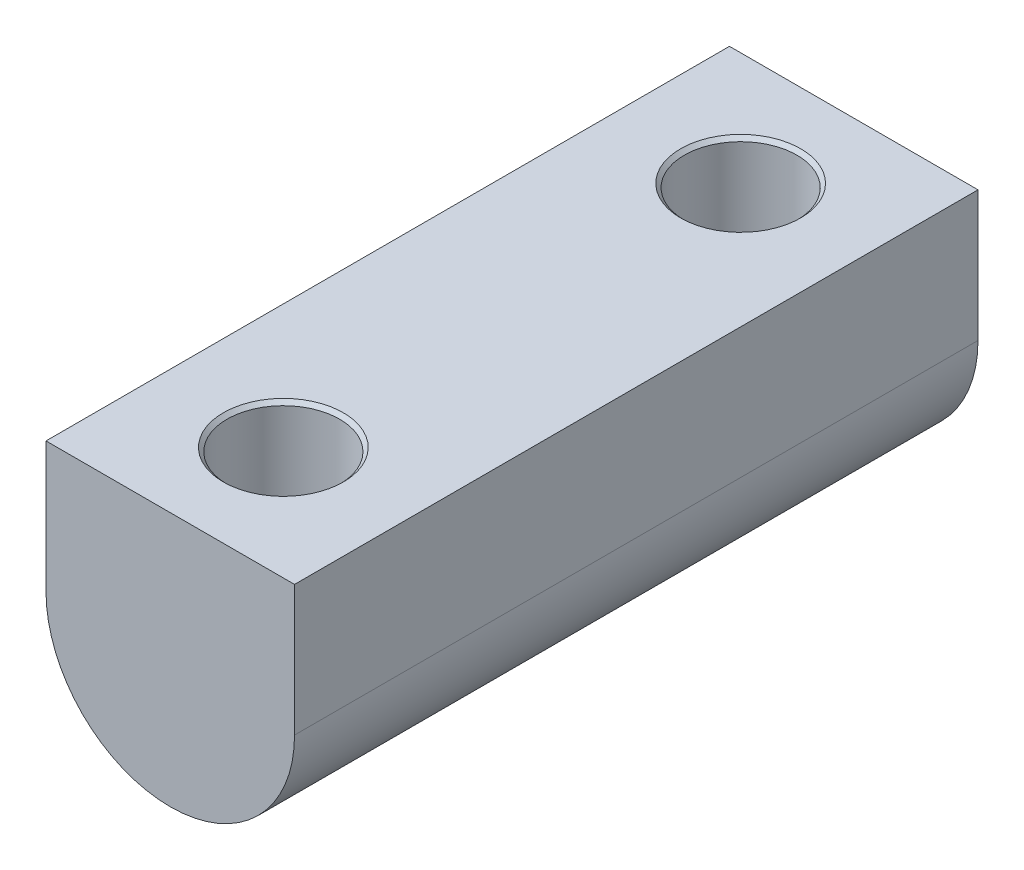
ISO-10303-21;
HEADER;
FILE_DESCRIPTION(('STEP AP214'),'2;1');
FILE_NAME('part.step','',(''),(''),'','','');
FILE_SCHEMA(('AUTOMOTIVE_DESIGN { 1 0 10303 214 1 1 1 1 }'));
ENDSEC;
DATA;
#1=APPLICATION_CONTEXT('core data for automotive mechanical design processes');
#2=APPLICATION_PROTOCOL_DEFINITION('international standard','automotive_design',2000,#1);
#3=PRODUCT_CONTEXT('',#1,'mechanical');
#4=PRODUCT('Part','Part','',(#3));
#5=PRODUCT_RELATED_PRODUCT_CATEGORY('part','',(#4));
#6=PRODUCT_DEFINITION_FORMATION('','',#4);
#7=PRODUCT_DEFINITION_CONTEXT('part definition',#1,'design');
#8=PRODUCT_DEFINITION('design','',#6,#7);
#9=PRODUCT_DEFINITION_SHAPE('','',#8);
#10=(LENGTH_UNIT() NAMED_UNIT(*) SI_UNIT(.MILLI.,.METRE.));
#11=(NAMED_UNIT(*) PLANE_ANGLE_UNIT() SI_UNIT($,.RADIAN.));
#12=(NAMED_UNIT(*) SI_UNIT($,.STERADIAN.) SOLID_ANGLE_UNIT());
#13=UNCERTAINTY_MEASURE_WITH_UNIT(LENGTH_MEASURE(1.E-05),#10,'distance_accuracy_value','');
#14=(GEOMETRIC_REPRESENTATION_CONTEXT(3) GLOBAL_UNCERTAINTY_ASSIGNED_CONTEXT((#13)) GLOBAL_UNIT_ASSIGNED_CONTEXT((#10,
#11,#12)) REPRESENTATION_CONTEXT('',''));
#15=CARTESIAN_POINT('',(0.,0.,0.));
#16=DIRECTION('',(0.,0.,1.));
#17=DIRECTION('',(1.,0.,0.));
#18=AXIS2_PLACEMENT_3D('',#15,#16,#17);
#19=CARTESIAN_POINT('',(-25.4,26.67,139.7));
#20=DIRECTION('',(0.,-1.,0.));
#21=DIRECTION('',(0.,0.,-1.));
#22=AXIS2_PLACEMENT_3D('',#19,#20,#21);
#23=PLANE('',#22);
#24=CARTESIAN_POINT('',(0.,26.67,23.114));
#25=DIRECTION('',(0.,1.,0.));
#26=DIRECTION('',(0.,0.,1.));
#27=AXIS2_PLACEMENT_3D('',#24,#25,#26);
#28=CIRCLE('',#27,12.2682);
#29=CARTESIAN_POINT('',(0.,26.67,35.3822));
#30=VERTEX_POINT('',#29);
#31=EDGE_CURVE('E235',#30,#30,#28,.T.);
#32=ORIENTED_EDGE('',*,*,#31,.F.);
#33=EDGE_LOOP('',(#32));
#34=FACE_BOUND('',#33,.T.);
#35=CARTESIAN_POINT('',(0.,26.67,116.586));
#36=DIRECTION('',(0.,1.,0.));
#37=DIRECTION('',(0.,0.,1.));
#38=AXIS2_PLACEMENT_3D('',#35,#36,#37);
#39=CIRCLE('',#38,12.2682);
#40=CARTESIAN_POINT('',(0.,26.67,128.8542));
#41=VERTEX_POINT('',#40);
#42=EDGE_CURVE('E185',#41,#41,#39,.T.);
#43=ORIENTED_EDGE('',*,*,#42,.F.);
#44=EDGE_LOOP('',(#43));
#45=FACE_BOUND('',#44,.T.);
#46=DIRECTION('',(-1.,0.,0.));
#47=VECTOR('',#46,1.);
#48=CARTESIAN_POINT('',(-25.4,26.67,0.));
#49=LINE('',#48,#47);
#50=CARTESIAN_POINT('',(25.4,26.67,0.));
#51=VERTEX_POINT('',#50);
#52=CARTESIAN_POINT('',(-25.4,26.67,0.));
#53=VERTEX_POINT('',#52);
#54=EDGE_CURVE('E183',#51,#53,#49,.T.);
#55=ORIENTED_EDGE('',*,*,#54,.T.);
#56=DIRECTION('',(0.,0.,-1.));
#57=VECTOR('',#56,1.);
#58=CARTESIAN_POINT('',(-25.4,26.67,139.7));
#59=LINE('',#58,#57);
#60=CARTESIAN_POINT('',(-25.4,26.67,139.7));
#61=VERTEX_POINT('',#60);
#62=EDGE_CURVE('E215',#61,#53,#59,.T.);
#63=ORIENTED_EDGE('',*,*,#62,.F.);
#64=DIRECTION('',(-1.,0.,0.));
#65=VECTOR('',#64,1.);
#66=CARTESIAN_POINT('',(-25.4,26.67,139.7));
#67=LINE('',#66,#65);
#68=CARTESIAN_POINT('',(25.4,26.67,139.7));
#69=VERTEX_POINT('',#68);
#70=EDGE_CURVE('E189',#69,#61,#67,.T.);
#71=ORIENTED_EDGE('',*,*,#70,.F.);
#72=DIRECTION('',(0.,0.,-1.));
#73=VECTOR('',#72,1.);
#74=CARTESIAN_POINT('',(25.4,26.67,139.7));
#75=LINE('',#74,#73);
#76=EDGE_CURVE('E199',#69,#51,#75,.T.);
#77=ORIENTED_EDGE('',*,*,#76,.T.);
#78=EDGE_LOOP('',(#55,#63,#71,#77));
#79=FACE_BOUND('',#78,.T.);
#80=ADVANCED_FACE('F32',(#34,#45,#79),#23,.F.);
#81=CARTESIAN_POINT('',(-25.4,0.,139.7));
#82=DIRECTION('',(1.,0.,0.));
#83=DIRECTION('',(0.,1.,0.));
#84=AXIS2_PLACEMENT_3D('',#81,#82,#83);
#85=PLANE('',#84);
#86=DIRECTION('',(0.,-1.,0.));
#87=VECTOR('',#86,1.);
#88=CARTESIAN_POINT('',(-25.4,0.,0.));
#89=LINE('',#88,#87);
#90=CARTESIAN_POINT('',(-25.4,0.,0.));
#91=VERTEX_POINT('',#90);
#92=EDGE_CURVE('E202',#53,#91,#89,.T.);
#93=ORIENTED_EDGE('',*,*,#92,.T.);
#94=DIRECTION('',(0.,0.,-1.));
#95=VECTOR('',#94,1.);
#96=CARTESIAN_POINT('',(-25.4,0.,139.7));
#97=LINE('',#96,#95);
#98=CARTESIAN_POINT('',(-25.4,0.,139.7));
#99=VERTEX_POINT('',#98);
#100=EDGE_CURVE('E212',#99,#91,#97,.T.);
#101=ORIENTED_EDGE('',*,*,#100,.F.);
#102=DIRECTION('',(0.,-1.,0.));
#103=VECTOR('',#102,1.);
#104=CARTESIAN_POINT('',(-25.4,0.,139.7));
#105=LINE('',#104,#103);
#106=EDGE_CURVE('E192',#61,#99,#105,.T.);
#107=ORIENTED_EDGE('',*,*,#106,.F.);
#108=ORIENTED_EDGE('',*,*,#62,.T.);
#109=EDGE_LOOP('',(#93,#101,#107,#108));
#110=FACE_BOUND('',#109,.T.);
#111=ADVANCED_FACE('F226',(#110),#85,.F.);
#112=CARTESIAN_POINT('',(0.,0.,139.7));
#113=DIRECTION('',(0.,0.,-1.));
#114=DIRECTION('',(-1.,0.,0.));
#115=AXIS2_PLACEMENT_3D('',#112,#113,#114);
#116=CYLINDRICAL_SURFACE('',#115,25.4);
#117=CARTESIAN_POINT('',(-6.16218261814553,-24.641175,13.3932377731348));
#118=CARTESIAN_POINT('',(-6.44191342892057,-24.5712453339657,13.5705526587333));
#119=CARTESIAN_POINT('',(-6.71339515120926,-24.4982689565312,13.7595870718681));
#120=CARTESIAN_POINT('',(-7.23838743542873,-24.3483047488872,14.1596550717247));
#121=CARTESIAN_POINT('',(-7.4919008553563,-24.2713175600233,14.3706851466154));
#122=CARTESIAN_POINT('',(-7.98009634270316,-24.1152229593519,14.813836485438));
#123=CARTESIAN_POINT('',(-8.21473687799224,-24.0361113563613,15.0460019911032));
#124=CARTESIAN_POINT('',(-8.6632753202409,-23.8781110022992,15.5296641318405));
#125=CARTESIAN_POINT('',(-8.87717237747819,-23.7992222604851,15.7811615580569));
#126=CARTESIAN_POINT('',(-9.28298489194657,-23.643887755276,16.3021737401673));
#127=CARTESIAN_POINT('',(-9.47489252217419,-23.5674428686939,16.5716948577612));
#128=CARTESIAN_POINT('',(-9.83531134444654,-23.4193215085058,17.1271839362858));
#129=CARTESIAN_POINT('',(-10.0038239817867,-23.3476447404778,17.4131508796816));
#130=CARTESIAN_POINT('',(-10.3159782819042,-23.2114106203455,17.9996520510586));
#131=CARTESIAN_POINT('',(-10.4596419428034,-23.1468469897513,18.3001730898304));
#132=CARTESIAN_POINT('',(-10.7209178039334,-23.0269972168615,18.9141295345266));
#133=CARTESIAN_POINT('',(-10.8385313269917,-22.9717106035131,19.2275642837328));
#134=CARTESIAN_POINT('',(-11.0429983040855,-22.8741035374996,19.8546933850308));
#135=CARTESIAN_POINT('',(-11.1307330395805,-22.8314177264025,20.1680430233582));
#136=CARTESIAN_POINT('',(-11.2795589208124,-22.7582610864342,20.8024227814634));
#137=CARTESIAN_POINT('',(-11.3406506790771,-22.7277899767458,21.1234527244903));
#138=CARTESIAN_POINT('',(-11.4353451061038,-22.6802931801161,21.7703505818019));
#139=CARTESIAN_POINT('',(-11.4689632366746,-22.663259930705,22.0962156696392));
#140=CARTESIAN_POINT('',(-11.5082787810938,-22.643321813047,22.750045996279));
#141=CARTESIAN_POINT('',(-11.5139786654205,-22.6404156946941,23.0780110466846));
#142=CARTESIAN_POINT('',(-11.4982143003797,-22.6484238127957,23.7003405873378));
#143=CARTESIAN_POINT('',(-11.4794025189142,-22.6579886088728,23.9947939989724));
#144=CARTESIAN_POINT('',(-11.4193238386268,-22.6883269107744,24.5807968441577));
#145=CARTESIAN_POINT('',(-11.3780586155195,-22.7090995801474,24.8723464927648));
#146=CARTESIAN_POINT('',(-11.2735428101021,-22.761164910562,25.4505044711947));
#147=CARTESIAN_POINT('',(-11.2102924721311,-22.7924574546873,25.7371128558968));
#148=CARTESIAN_POINT('',(-11.0624679755939,-22.864569847183,26.3035451936817));
#149=CARTESIAN_POINT('',(-10.9778931178168,-22.9053900079517,26.5833689239723));
#150=CARTESIAN_POINT('',(-10.7880685902922,-22.9954042216774,27.1350090847275));
#151=CARTESIAN_POINT('',(-10.682786919897,-23.044611219885,27.4068123629408));
#152=CARTESIAN_POINT('',(-10.4524675729035,-23.1499882212746,27.9406102668827));
#153=CARTESIAN_POINT('',(-10.3274233481846,-23.2061605310078,28.2026016058085));
#154=CARTESIAN_POINT('',(-10.0584051391043,-23.3240231875673,28.7156204918425));
#155=CARTESIAN_POINT('',(-9.91441763912759,-23.3857174640544,28.9666400388337));
#156=CARTESIAN_POINT('',(-9.60847376693834,-23.5130747501233,29.4564230077683));
#157=CARTESIAN_POINT('',(-9.44651640228219,-23.5787379788121,29.6951857517242));
#158=CARTESIAN_POINT('',(-9.0882943309944,-23.719265475134,30.1828870174996));
#159=CARTESIAN_POINT('',(-8.8902168604682,-23.7943895971751,30.4304212372558));
#160=CARTESIAN_POINT('',(-8.47455641488981,-23.9455794969405,30.9080883724703));
#161=CARTESIAN_POINT('',(-8.25697877055135,-24.0216450124474,31.1382260120679));
#162=CARTESIAN_POINT('',(-7.80383417304395,-24.1726522408291,31.5795629315074));
#163=CARTESIAN_POINT('',(-7.56829920511696,-24.247595679975,31.7907944916206));
#164=CARTESIAN_POINT('',(-7.08020012273026,-24.3945821858311,32.1934528344003));
#165=CARTESIAN_POINT('',(-6.82764694019815,-24.4666270678541,32.3848921343595));
#166=CARTESIAN_POINT('',(-6.50075070358878,-24.5541237874548,32.6120273422549));
#167=CARTESIAN_POINT('',(-6.43370992289067,-24.5717775073043,32.6575667950416));
#168=CARTESIAN_POINT('',(-6.29867203567288,-24.6067386320881,32.7472238966789));
#169=CARTESIAN_POINT('',(-6.23067569357582,-24.6240462896904,32.7913425983808));
#170=CARTESIAN_POINT('',(-6.16218261814553,-24.641175,32.8347622268652));
#171=B_SPLINE_CURVE_WITH_KNOTS('',3,(#117,#118,#119,#120,#121,#122,#123,#124,#125,#126,#127,
#128,#129,#130,#131,#132,#133,#134,#135,#136,#137,#138,#139,#140,#141,#142,#143,#144,#145,#146,
#147,#148,#149,#150,#151,#152,#153,#154,#155,#156,#157,#158,#159,#160,#161,#162,#163,#164,#165,
#166,#167,#168,#169,#170),.UNSPECIFIED.,.F.,.F.,(4,2,2,2,2,2,2,2,2,2,2,2,2,2,2,2,2,2,2,2,2,2,2,
2,2,2,4),(0.,1.0151067998878,2.03005177519394,3.04717240405228,4.0643346799919,5.08185789132828,
6.09931821413678,7.11587314494733,8.132376443198,9.11558762481931,10.0987762010133,
11.0814110693672,12.0639589830415,12.9485143613801,13.8330037338446,14.7174832765508,
15.6019918242804,16.4878782016516,17.3740587261939,18.2608749853606,19.1477402462081,
20.1240958100394,21.1001852793828,22.0745750458268,23.0483447563993,23.2971701228159,
23.5458066424416),.UNSPECIFIED.);
#172=CARTESIAN_POINT('',(-6.16218261814578,-24.641175,13.3932377731348));
#173=VERTEX_POINT('',#172);
#174=CARTESIAN_POINT('',(-6.16218261814553,-24.641175,32.8347622268652));
#175=VERTEX_POINT('',#174);
#176=EDGE_CURVE('E107',#173,#175,#171,.T.);
#177=ORIENTED_EDGE('',*,*,#176,.T.);
#178=CARTESIAN_POINT('',(-6.45881029806911,-24.5650925,32.548190316297));
#179=CARTESIAN_POINT('',(-6.26240196904254,-24.6167336657644,32.7452458499962));
#180=CARTESIAN_POINT('',(-6.05837654376768,-24.6678587753081,32.934990924439));
#181=CARTESIAN_POINT('',(-5.63534504801485,-24.7679265977663,33.2981846652509));
#182=CARTESIAN_POINT('',(-5.41631980681127,-24.8168663806434,33.4716117783393));
#183=CARTESIAN_POINT('',(-4.96284546434878,-24.9115252046395,33.8008500716212));
#184=CARTESIAN_POINT('',(-4.72832003002384,-24.9572255898274,33.9565619168995));
#185=CARTESIAN_POINT('',(-4.24592372455164,-25.0438038905117,34.2470724861902));
#186=CARTESIAN_POINT('',(-3.99806018530966,-25.0846844168137,34.3818825447996));
#187=CARTESIAN_POINT('',(-3.53502306400233,-25.1536943197178,34.6067215332955));
#188=CARTESIAN_POINT('',(-3.32178992719408,-25.1828010982893,34.7004552684766));
#189=CARTESIAN_POINT('',(-2.8881211655666,-25.2362132140815,34.8710886961727));
#190=CARTESIAN_POINT('',(-2.66768685232898,-25.2605194200318,34.9479914347607));
#191=CARTESIAN_POINT('',(-2.22138414977597,-25.3036673635464,35.0836953197831));
#192=CARTESIAN_POINT('',(-1.9955307164065,-25.3225226046793,35.1425412206926));
#193=CARTESIAN_POINT('',(-1.53932810370089,-25.3543436473139,35.2414589079046));
#194=CARTESIAN_POINT('',(-1.30897896692402,-25.3673095045402,35.2815308718437));
#195=CARTESIAN_POINT('',(-0.844419566337968,-25.3870289875341,35.3423529552535));
#196=CARTESIAN_POINT('',(-0.610196640220688,-25.3937545656943,35.3630158436324));
#197=CARTESIAN_POINT('',(-0.140740277769136,-25.4006948726566,35.3843370824184));
#198=CARTESIAN_POINT('',(0.0944931674837493,-25.4009095438763,35.3849952559042));
#199=CARTESIAN_POINT('',(0.564134638538382,-25.3948206844323,35.3662921044337));
#200=CARTESIAN_POINT('',(0.798542439221797,-25.3885154961623,35.3469256884346));
#201=CARTESIAN_POINT('',(1.2646186660876,-25.3695712118022,35.2885167285817));
#202=CARTESIAN_POINT('',(1.49628716969701,-25.3569322951768,35.2494747422309));
#203=CARTESIAN_POINT('',(1.94267707063293,-25.3265332739928,35.1550329149762));
#204=CARTESIAN_POINT('',(2.15763410589165,-25.3090897100041,35.10064020883));
#205=CARTESIAN_POINT('',(2.58234750357772,-25.2692907938601,34.97565376219));
#206=CARTESIAN_POINT('',(2.79210212595171,-25.2469338223267,34.9050546799997));
#207=CARTESIAN_POINT('',(3.41230690662832,-25.173184540836,34.6701253556688));
#208=CARTESIAN_POINT('',(3.81341652206548,-25.115134043209,34.4827241332053));
#209=CARTESIAN_POINT('',(4.61642922997843,-24.9805630697333,34.0367082415512));
#210=CARTESIAN_POINT('',(5.01550488001561,-24.9028924601575,33.7733962312934));
#211=CARTESIAN_POINT('',(5.58162094334254,-24.7798851758998,33.3403382926949));
#212=CARTESIAN_POINT('',(5.76460755628981,-24.7378811901644,33.1899442693297));
#213=CARTESIAN_POINT('',(6.11979206682041,-24.6524118412353,32.8775359735813));
#214=CARTESIAN_POINT('',(6.291997415195,-24.6089475199071,32.7155298959844));
#215=CARTESIAN_POINT('',(6.45881029806911,-24.5650925,32.548190316297));
#216=B_SPLINE_CURVE_WITH_KNOTS('',3,(#178,#179,#180,#181,#182,#183,#184,#185,#186,#187,#188,
#189,#190,#191,#192,#193,#194,#195,#196,#197,#198,#199,#200,#201,#202,#203,#204,#205,#206,#207,
#208,#209,#210,#211,#212,#213,#214,#215),.UNSPECIFIED.,.F.,.F.,(4,2,2,2,2,2,2,2,2,2,2,2,2,2,2,2,
2,2,4),(0.,0.848877466539811,1.69886086420922,2.55339716233528,3.40746843041591,
4.11097213252556,4.81434840908948,5.51596699383079,6.21757893980853,6.92232929343885,
7.62708587986797,8.3320216873696,9.03693752179431,9.70344682348516,10.3701761259578,
11.7044912788221,13.1521612537161,13.873385791261,14.5941062690893),.UNSPECIFIED.);
#217=CARTESIAN_POINT('',(6.16218261814553,-24.641175,32.8347622268652));
#218=VERTEX_POINT('',#217);
#219=EDGE_CURVE('E11',#175,#218,#216,.T.);
#220=ORIENTED_EDGE('',*,*,#219,.T.);
#221=CARTESIAN_POINT('',(6.16218261814553,-24.641175,32.8347622268652));
#222=CARTESIAN_POINT('',(6.44191342892057,-24.5712453339657,32.6574473412667));
#223=CARTESIAN_POINT('',(6.71339515120926,-24.4982689565312,32.4684129281319));
#224=CARTESIAN_POINT('',(7.23838743542874,-24.3483047488872,32.0683449282753));
#225=CARTESIAN_POINT('',(7.4919008553563,-24.2713175600233,31.8573148533846));
#226=CARTESIAN_POINT('',(7.98009634270316,-24.1152229593519,31.414163514562));
#227=CARTESIAN_POINT('',(8.21473687799225,-24.0361113563613,31.1819980088968));
#228=CARTESIAN_POINT('',(8.6632753202409,-23.8781110022992,30.6983358681595));
#229=CARTESIAN_POINT('',(8.87717237747819,-23.7992222604851,30.4468384419431));
#230=CARTESIAN_POINT('',(9.28298489194657,-23.643887755276,29.9258262598327));
#231=CARTESIAN_POINT('',(9.4748925221742,-23.5674428686939,29.6563051422388));
#232=CARTESIAN_POINT('',(9.83531134444655,-23.4193215085059,29.1008160637142));
#233=CARTESIAN_POINT('',(10.0038239817867,-23.3476447404778,28.8148491203184));
#234=CARTESIAN_POINT('',(10.3159782819042,-23.2114106203455,28.2283479489414));
#235=CARTESIAN_POINT('',(10.4596419428034,-23.1468469897513,27.9278269101696));
#236=CARTESIAN_POINT('',(10.7209178039334,-23.0269972168615,27.3138704654734));
#237=CARTESIAN_POINT('',(10.8385313269917,-22.9717106035131,27.0004357162671));
#238=CARTESIAN_POINT('',(11.0429983040855,-22.8741035374996,26.3733066149692));
#239=CARTESIAN_POINT('',(11.1307330395805,-22.8314177264025,26.0599569766418));
#240=CARTESIAN_POINT('',(11.2795589208124,-22.7582610864342,25.4255772185366));
#241=CARTESIAN_POINT('',(11.3406506790771,-22.7277899767458,25.1045472755097));
#242=CARTESIAN_POINT('',(11.4353451061038,-22.6802931801161,24.4576494181981));
#243=CARTESIAN_POINT('',(11.4689632366746,-22.663259930705,24.1317843303608));
#244=CARTESIAN_POINT('',(11.5082787810938,-22.643321813047,23.477954003721));
#245=CARTESIAN_POINT('',(11.5139786654205,-22.6404156946941,23.1499889533154));
#246=CARTESIAN_POINT('',(11.4982143003797,-22.6484238127957,22.5276594126622));
#247=CARTESIAN_POINT('',(11.4794025189142,-22.6579886088728,22.2332060010275));
#248=CARTESIAN_POINT('',(11.4193238386268,-22.6883269107744,21.6472031558423));
#249=CARTESIAN_POINT('',(11.3780586155195,-22.7090995801474,21.3556535072352));
#250=CARTESIAN_POINT('',(11.2735428101021,-22.761164910562,20.7774955288053));
#251=CARTESIAN_POINT('',(11.2102924721311,-22.7924574546873,20.4908871441032));
#252=CARTESIAN_POINT('',(11.0624679755939,-22.864569847183,19.9244548063183));
#253=CARTESIAN_POINT('',(10.9778931178168,-22.9053900079517,19.6446310760277));
#254=CARTESIAN_POINT('',(10.7880685902922,-22.9954042216774,19.0929909152725));
#255=CARTESIAN_POINT('',(10.682786919897,-23.044611219885,18.8211876370591));
#256=CARTESIAN_POINT('',(10.4524675729035,-23.1499882212746,18.2873897331173));
#257=CARTESIAN_POINT('',(10.3274233481846,-23.2061605310078,18.0253983941915));
#258=CARTESIAN_POINT('',(10.0584051391043,-23.3240231875673,17.5123795081575));
#259=CARTESIAN_POINT('',(9.91441763912759,-23.3857174640544,17.2613599611663));
#260=CARTESIAN_POINT('',(9.60847376693834,-23.5130747501233,16.7715769922317));
#261=CARTESIAN_POINT('',(9.44651640228219,-23.5787379788121,16.5328142482758));
#262=CARTESIAN_POINT('',(9.0882943309944,-23.719265475134,16.0451129825004));
#263=CARTESIAN_POINT('',(8.8902168604682,-23.7943895971751,15.7975787627442));
#264=CARTESIAN_POINT('',(8.4745564148898,-23.9455794969405,15.3199116275297));
#265=CARTESIAN_POINT('',(8.25697877055135,-24.0216450124474,15.0897739879321));
#266=CARTESIAN_POINT('',(7.80383417304395,-24.1726522408291,14.6484370684926));
#267=CARTESIAN_POINT('',(7.56829920511695,-24.247595679975,14.4372055083794));
#268=CARTESIAN_POINT('',(7.08020012273026,-24.3945821858311,14.0345471655997));
#269=CARTESIAN_POINT('',(6.82764694019815,-24.4666270678541,13.8431078656405));
#270=CARTESIAN_POINT('',(6.50075070358878,-24.5541237874548,13.615972657745));
#271=CARTESIAN_POINT('',(6.43370992289067,-24.5717775073044,13.5704332049584));
#272=CARTESIAN_POINT('',(6.29867203567287,-24.6067386320881,13.4807761033211));
#273=CARTESIAN_POINT('',(6.23067569357581,-24.6240462896904,13.4366574016191));
#274=CARTESIAN_POINT('',(6.16218261814553,-24.641175,13.3932377731348));
#275=B_SPLINE_CURVE_WITH_KNOTS('',3,(#221,#222,#223,#224,#225,#226,#227,#228,#229,#230,#231,
#232,#233,#234,#235,#236,#237,#238,#239,#240,#241,#242,#243,#244,#245,#246,#247,#248,#249,#250,
#251,#252,#253,#254,#255,#256,#257,#258,#259,#260,#261,#262,#263,#264,#265,#266,#267,#268,#269,
#270,#271,#272,#273,#274),.UNSPECIFIED.,.F.,.F.,(4,2,2,2,2,2,2,2,2,2,2,2,2,2,2,2,2,2,2,2,2,2,2,
2,2,2,4),(0.,1.01510679988781,2.03005177519395,3.04717240405228,4.0643346799919,
5.08185789132828,6.09931821413678,7.11587314494733,8.132376443198,9.11558762481931,
10.0987762010133,11.0814110693671,12.0639589830415,12.9485143613801,13.8330037338446,
14.7174832765508,15.6019918242804,16.4878782016516,17.3740587261939,18.2608749853606,
19.1477402462081,20.1240958100394,21.1001852793828,22.0745750458268,23.0483447563994,
23.297170122816,23.5458066424416),.UNSPECIFIED.);
#276=CARTESIAN_POINT('',(6.16218261814553,-24.641175,13.3932377731348));
#277=VERTEX_POINT('',#276);
#278=EDGE_CURVE('E44',#218,#277,#275,.T.);
#279=ORIENTED_EDGE('',*,*,#278,.T.);
#280=CARTESIAN_POINT('',(6.45881029806911,-24.5650925,13.679809683703));
#281=CARTESIAN_POINT('',(6.26240196904254,-24.6167336657644,13.4827541500038));
#282=CARTESIAN_POINT('',(6.05837654376768,-24.6678587753081,13.293009075561));
#283=CARTESIAN_POINT('',(5.63534504801486,-24.7679265977663,12.929815334749));
#284=CARTESIAN_POINT('',(5.41631980681127,-24.8168663806434,12.7563882216607));
#285=CARTESIAN_POINT('',(4.96284546434878,-24.9115252046395,12.4271499283787));
#286=CARTESIAN_POINT('',(4.72832003002384,-24.9572255898274,12.2714380831005));
#287=CARTESIAN_POINT('',(4.24592372455164,-25.0438038905117,11.9809275138098));
#288=CARTESIAN_POINT('',(3.99806018530966,-25.0846844168137,11.8461174552004));
#289=CARTESIAN_POINT('',(3.53502306400233,-25.1536943197178,11.6212784667045));
#290=CARTESIAN_POINT('',(3.32178992719408,-25.1828010982893,11.5275447315234));
#291=CARTESIAN_POINT('',(2.88812116556661,-25.2362132140815,11.3569113038273));
#292=CARTESIAN_POINT('',(2.66768685232898,-25.2605194200318,11.2800085652393));
#293=CARTESIAN_POINT('',(2.22138414977598,-25.3036673635464,11.1443046802169));
#294=CARTESIAN_POINT('',(1.9955307164065,-25.3225226046793,11.0854587793073));
#295=CARTESIAN_POINT('',(1.53932810370089,-25.3543436473139,10.9865410920954));
#296=CARTESIAN_POINT('',(1.30897896692402,-25.3673095045402,10.9464691281563));
#297=CARTESIAN_POINT('',(0.844419566337971,-25.3870289875341,10.8856470447465));
#298=CARTESIAN_POINT('',(0.61019664022069,-25.3937545656943,10.8649841563676));
#299=CARTESIAN_POINT('',(0.140740277769137,-25.4006948726566,10.8436629175816));
#300=CARTESIAN_POINT('',(-0.0944931674837482,-25.4009095438763,10.8430047440958));
#301=CARTESIAN_POINT('',(-0.564134638538381,-25.3948206844323,10.8617078955663));
#302=CARTESIAN_POINT('',(-0.798542439221796,-25.3885154961623,10.8810743115654));
#303=CARTESIAN_POINT('',(-1.2646186660876,-25.3695712118022,10.9394832714183));
#304=CARTESIAN_POINT('',(-1.49628716969701,-25.3569322951768,10.9785252577691));
#305=CARTESIAN_POINT('',(-1.94267707063293,-25.3265332739928,11.0729670850238));
#306=CARTESIAN_POINT('',(-2.15763410589165,-25.3090897100041,11.12735979117));
#307=CARTESIAN_POINT('',(-2.58234750357773,-25.2692907938601,11.25234623781));
#308=CARTESIAN_POINT('',(-2.79210212595171,-25.2469338223267,11.3229453200002));
#309=CARTESIAN_POINT('',(-3.41230690662832,-25.173184540836,11.5578746443311));
#310=CARTESIAN_POINT('',(-3.81341652206548,-25.115134043209,11.7452758667947));
#311=CARTESIAN_POINT('',(-4.61642922997843,-24.9805630697333,12.1912917584488));
#312=CARTESIAN_POINT('',(-5.01550488001561,-24.9028924601575,12.4546037687066));
#313=CARTESIAN_POINT('',(-5.58162094334255,-24.7798851758998,12.887661707305));
#314=CARTESIAN_POINT('',(-5.76460755628981,-24.7378811901644,13.0380557306703));
#315=CARTESIAN_POINT('',(-6.11979206682042,-24.6524118412353,13.3504640264187));
#316=CARTESIAN_POINT('',(-6.291997415195,-24.6089475199071,13.5124701040155));
#317=CARTESIAN_POINT('',(-6.45881029806911,-24.5650925,13.679809683703));
#318=B_SPLINE_CURVE_WITH_KNOTS('',3,(#280,#281,#282,#283,#284,#285,#286,#287,#288,#289,#290,
#291,#292,#293,#294,#295,#296,#297,#298,#299,#300,#301,#302,#303,#304,#305,#306,#307,#308,#309,
#310,#311,#312,#313,#314,#315,#316,#317),.UNSPECIFIED.,.F.,.F.,(4,2,2,2,2,2,2,2,2,2,2,2,2,2,2,2,
2,2,4),(0.,0.848877466539813,1.69886086420923,2.55339716233528,3.40746843041591,
4.11097213252556,4.81434840908949,5.5159669938308,6.21757893980853,6.92232929343885,
7.62708587986798,8.3320216873696,9.03693752179431,9.70344682348516,10.3701761259578,
11.7044912788221,13.1521612537161,13.873385791261,14.5941062690893),.UNSPECIFIED.);
#319=EDGE_CURVE('E114',#277,#173,#318,.T.);
#320=ORIENTED_EDGE('',*,*,#319,.T.);
#321=EDGE_LOOP('',(#177,#220,#279,#320));
#322=FACE_BOUND('',#321,.T.);
#323=CARTESIAN_POINT('',(-6.16218261814553,-24.641175,106.865237773135));
#324=CARTESIAN_POINT('',(-6.44191342892057,-24.5712453339657,107.042552658733));
#325=CARTESIAN_POINT('',(-6.71339515120926,-24.4982689565312,107.231587071868));
#326=CARTESIAN_POINT('',(-7.23838743542873,-24.3483047488872,107.631655071725));
#327=CARTESIAN_POINT('',(-7.4919008553563,-24.2713175600233,107.842685146615));
#328=CARTESIAN_POINT('',(-7.98009634270316,-24.1152229593519,108.285836485438));
#329=CARTESIAN_POINT('',(-8.21473687799225,-24.0361113563613,108.518001991103));
#330=CARTESIAN_POINT('',(-8.6632753202409,-23.8781110022992,109.001664131841));
#331=CARTESIAN_POINT('',(-8.87717237747819,-23.7992222604851,109.253161558057));
#332=CARTESIAN_POINT('',(-9.28298489194657,-23.643887755276,109.774173740167));
#333=CARTESIAN_POINT('',(-9.47489252217419,-23.5674428686939,110.043694857761));
#334=CARTESIAN_POINT('',(-9.83531134444654,-23.4193215085058,110.599183936286));
#335=CARTESIAN_POINT('',(-10.0038239817867,-23.3476447404778,110.885150879682));
#336=CARTESIAN_POINT('',(-10.3159782819042,-23.2114106203455,111.471652051059));
#337=CARTESIAN_POINT('',(-10.4596419428034,-23.1468469897513,111.77217308983));
#338=CARTESIAN_POINT('',(-10.7209178039334,-23.0269972168615,112.386129534527));
#339=CARTESIAN_POINT('',(-10.8385313269917,-22.9717106035131,112.699564283733));
#340=CARTESIAN_POINT('',(-11.0429983040855,-22.8741035374996,113.326693385031));
#341=CARTESIAN_POINT('',(-11.1307330395805,-22.8314177264025,113.640043023358));
#342=CARTESIAN_POINT('',(-11.2795589208124,-22.7582610864342,114.274422781463));
#343=CARTESIAN_POINT('',(-11.3406506790771,-22.7277899767458,114.59545272449));
#344=CARTESIAN_POINT('',(-11.4353451061037,-22.6802931801162,115.242350581802));
#345=CARTESIAN_POINT('',(-11.4689632366746,-22.663259930705,115.568215669639));
#346=CARTESIAN_POINT('',(-11.5082787810937,-22.643321813047,116.222045996279));
#347=CARTESIAN_POINT('',(-11.5139786654205,-22.6404156946941,116.550011046685));
#348=CARTESIAN_POINT('',(-11.4982143003797,-22.6484238127957,117.172340587338));
#349=CARTESIAN_POINT('',(-11.4794025189142,-22.6579886088728,117.466793998972));
#350=CARTESIAN_POINT('',(-11.4193238386268,-22.6883269107744,118.052796844158));
#351=CARTESIAN_POINT('',(-11.3780586155195,-22.7090995801474,118.344346492765));
#352=CARTESIAN_POINT('',(-11.2735428101021,-22.761164910562,118.922504471195));
#353=CARTESIAN_POINT('',(-11.210292472131,-22.7924574546873,119.209112855897));
#354=CARTESIAN_POINT('',(-11.0624679755938,-22.864569847183,119.775545193682));
#355=CARTESIAN_POINT('',(-10.9778931178168,-22.9053900079517,120.055368923972));
#356=CARTESIAN_POINT('',(-10.7880685902921,-22.9954042216774,120.607009084728));
#357=CARTESIAN_POINT('',(-10.682786919897,-23.044611219885,120.878812362941));
#358=CARTESIAN_POINT('',(-10.4524675729034,-23.1499882212746,121.412610266883));
#359=CARTESIAN_POINT('',(-10.3274233481846,-23.2061605310078,121.674601605808));
#360=CARTESIAN_POINT('',(-10.0584051391042,-23.3240231875673,122.187620491842));
#361=CARTESIAN_POINT('',(-9.91441763912758,-23.3857174640544,122.438640038834));
#362=CARTESIAN_POINT('',(-9.60847376693832,-23.5130747501233,122.928423007768));
#363=CARTESIAN_POINT('',(-9.44651640228217,-23.5787379788121,123.167185751724));
#364=CARTESIAN_POINT('',(-9.08829433099439,-23.719265475134,123.6548870175));
#365=CARTESIAN_POINT('',(-8.89021686046817,-23.7943895971751,123.902421237256));
#366=CARTESIAN_POINT('',(-8.47455641488978,-23.9455794969405,124.38008837247));
#367=CARTESIAN_POINT('',(-8.25697877055132,-24.0216450124474,124.610226012068));
#368=CARTESIAN_POINT('',(-7.80383417304392,-24.1726522408291,125.051562931507));
#369=CARTESIAN_POINT('',(-7.56829920511692,-24.247595679975,125.262794491621));
#370=CARTESIAN_POINT('',(-7.08020012273022,-24.3945821858311,125.6654528344));
#371=CARTESIAN_POINT('',(-6.8276469401981,-24.4666270678541,125.856892134359));
#372=CARTESIAN_POINT('',(-6.50075070358874,-24.5541237874548,126.084027342255));
#373=CARTESIAN_POINT('',(-6.43370992289064,-24.5717775073044,126.129566795042));
#374=CARTESIAN_POINT('',(-6.29867203567286,-24.6067386320881,126.219223896679));
#375=CARTESIAN_POINT('',(-6.2306756935758,-24.6240462896904,126.263342598381));
#376=CARTESIAN_POINT('',(-6.16218261814553,-24.641175,126.306762226865));
#377=B_SPLINE_CURVE_WITH_KNOTS('',3,(#323,#324,#325,#326,#327,#328,#329,#330,#331,#332,#333,
#334,#335,#336,#337,#338,#339,#340,#341,#342,#343,#344,#345,#346,#347,#348,#349,#350,#351,#352,
#353,#354,#355,#356,#357,#358,#359,#360,#361,#362,#363,#364,#365,#366,#367,#368,#369,#370,#371,
#372,#373,#374,#375,#376),.UNSPECIFIED.,.F.,.F.,(4,2,2,2,2,2,2,2,2,2,2,2,2,2,2,2,2,2,2,2,2,2,2,
2,2,2,4),(0.,1.0151067998878,2.03005177519395,3.04717240405227,4.06433467999191,
5.08185789132827,6.09931821413678,7.11587314494734,8.13237644319801,9.11558762481931,
10.0987762010133,11.0814110693672,12.0639589830415,12.9485143613801,13.8330037338446,
14.7174832765508,15.6019918242805,16.4878782016516,17.3740587261939,18.2608749853606,
19.1477402462081,20.1240958100394,21.1001852793828,22.0745750458268,23.0483447563994,
23.2971701228159,23.5458066424416),.UNSPECIFIED.);
#378=CARTESIAN_POINT('',(-6.16218261814578,-24.641175,106.865237773135));
#379=VERTEX_POINT('',#378);
#380=CARTESIAN_POINT('',(-6.16218261814553,-24.641175,126.306762226865));
#381=VERTEX_POINT('',#380);
#382=EDGE_CURVE('E158',#379,#381,#377,.T.);
#383=ORIENTED_EDGE('',*,*,#382,.T.);
#384=CARTESIAN_POINT('',(-6.45881029806911,-24.5650925,126.020190316297));
#385=CARTESIAN_POINT('',(-6.26240196904255,-24.6167336657644,126.217245849996));
#386=CARTESIAN_POINT('',(-6.05837654376769,-24.6678587753081,126.406990924439));
#387=CARTESIAN_POINT('',(-5.63534504801486,-24.7679265977663,126.770184665251));
#388=CARTESIAN_POINT('',(-5.41631980681127,-24.8168663806434,126.943611778339));
#389=CARTESIAN_POINT('',(-4.96284546434878,-24.9115252046395,127.272850071621));
#390=CARTESIAN_POINT('',(-4.72832003002384,-24.9572255898274,127.428561916899));
#391=CARTESIAN_POINT('',(-4.24592372455164,-25.0438038905117,127.71907248619));
#392=CARTESIAN_POINT('',(-3.99806018530966,-25.0846844168137,127.8538825448));
#393=CARTESIAN_POINT('',(-3.53502306400233,-25.1536943197178,128.078721533295));
#394=CARTESIAN_POINT('',(-3.32178992719408,-25.1828010982893,128.172455268477));
#395=CARTESIAN_POINT('',(-2.88812116556661,-25.2362132140815,128.343088696173));
#396=CARTESIAN_POINT('',(-2.66768685232898,-25.2605194200318,128.419991434761));
#397=CARTESIAN_POINT('',(-2.22138414977598,-25.3036673635464,128.555695319783));
#398=CARTESIAN_POINT('',(-1.99553071640651,-25.3225226046793,128.614541220693));
#399=CARTESIAN_POINT('',(-1.53932810370089,-25.3543436473139,128.713458907905));
#400=CARTESIAN_POINT('',(-1.30897896692402,-25.3673095045402,128.753530871844));
#401=CARTESIAN_POINT('',(-0.844419566337967,-25.3870289875341,128.814352955253));
#402=CARTESIAN_POINT('',(-0.610196640220687,-25.3937545656943,128.835015843632));
#403=CARTESIAN_POINT('',(-0.140740277769133,-25.4006948726566,128.856337082418));
#404=CARTESIAN_POINT('',(0.0944931674837525,-25.4009095438763,128.856995255904));
#405=CARTESIAN_POINT('',(0.564134638538386,-25.3948206844323,128.838292104434));
#406=CARTESIAN_POINT('',(0.7985424392218,-25.3885154961623,128.818925688435));
#407=CARTESIAN_POINT('',(1.2646186660876,-25.3695712118022,128.760516728582));
#408=CARTESIAN_POINT('',(1.49628716969702,-25.3569322951768,128.721474742231));
#409=CARTESIAN_POINT('',(1.94267707063294,-25.3265332739928,128.627032914976));
#410=CARTESIAN_POINT('',(2.15763410589165,-25.3090897100041,128.57264020883));
#411=CARTESIAN_POINT('',(2.58234750357773,-25.2692907938601,128.44765376219));
#412=CARTESIAN_POINT('',(2.79210212595172,-25.2469338223267,128.37705468));
#413=CARTESIAN_POINT('',(3.41230690662833,-25.173184540836,128.142125355669));
#414=CARTESIAN_POINT('',(3.81341652206548,-25.115134043209,127.954724133205));
#415=CARTESIAN_POINT('',(4.61642922997843,-24.9805630697333,127.508708241551));
#416=CARTESIAN_POINT('',(5.01550488001562,-24.9028924601575,127.245396231293));
#417=CARTESIAN_POINT('',(5.58162094334255,-24.7798851758998,126.812338292695));
#418=CARTESIAN_POINT('',(5.76460755628982,-24.7378811901644,126.66194426933));
#419=CARTESIAN_POINT('',(6.11979206682042,-24.6524118412353,126.349535973581));
#420=CARTESIAN_POINT('',(6.291997415195,-24.6089475199071,126.187529895984));
#421=CARTESIAN_POINT('',(6.45881029806911,-24.5650925,126.020190316297));
#422=B_SPLINE_CURVE_WITH_KNOTS('',3,(#384,#385,#386,#387,#388,#389,#390,#391,#392,#393,#394,
#395,#396,#397,#398,#399,#400,#401,#402,#403,#404,#405,#406,#407,#408,#409,#410,#411,#412,#413,
#414,#415,#416,#417,#418,#419,#420,#421),.UNSPECIFIED.,.F.,.F.,(4,2,2,2,2,2,2,2,2,2,2,2,2,2,2,2,
2,2,4),(0.,0.848877466539808,1.69886086420923,2.55339716233528,3.40746843041591,
4.11097213252557,4.81434840908949,5.5159669938308,6.21757893980854,6.92232929343886,
7.62708587986799,8.33202168736961,9.03693752179432,9.70344682348516,10.3701761259578,
11.7044912788222,13.1521612537161,13.873385791261,14.5941062690893),.UNSPECIFIED.);
#423=CARTESIAN_POINT('',(6.16218261814553,-24.641175,126.306762226865));
#424=VERTEX_POINT('',#423);
#425=EDGE_CURVE('E116',#381,#424,#422,.T.);
#426=ORIENTED_EDGE('',*,*,#425,.T.);
#427=CARTESIAN_POINT('',(6.16218261814553,-24.641175,126.306762226865));
#428=CARTESIAN_POINT('',(6.44191342892056,-24.5712453339657,126.129447341267));
#429=CARTESIAN_POINT('',(6.71339515120925,-24.4982689565312,125.940412928132));
#430=CARTESIAN_POINT('',(7.23838743542873,-24.3483047488872,125.540344928275));
#431=CARTESIAN_POINT('',(7.4919008553563,-24.2713175600233,125.329314853385));
#432=CARTESIAN_POINT('',(7.98009634270316,-24.1152229593519,124.886163514562));
#433=CARTESIAN_POINT('',(8.21473687799225,-24.0361113563613,124.653998008897));
#434=CARTESIAN_POINT('',(8.6632753202409,-23.8781110022992,124.170335868159));
#435=CARTESIAN_POINT('',(8.87717237747819,-23.7992222604851,123.918838441943));
#436=CARTESIAN_POINT('',(9.28298489194657,-23.643887755276,123.397826259833));
#437=CARTESIAN_POINT('',(9.4748925221742,-23.5674428686939,123.128305142239));
#438=CARTESIAN_POINT('',(9.83531134444655,-23.4193215085058,122.572816063714));
#439=CARTESIAN_POINT('',(10.0038239817867,-23.3476447404778,122.286849120318));
#440=CARTESIAN_POINT('',(10.3159782819042,-23.2114106203455,121.700347948941));
#441=CARTESIAN_POINT('',(10.4596419428034,-23.1468469897513,121.39982691017));
#442=CARTESIAN_POINT('',(10.7209178039334,-23.0269972168615,120.785870465473));
#443=CARTESIAN_POINT('',(10.8385313269917,-22.9717106035131,120.472435716267));
#444=CARTESIAN_POINT('',(11.0429983040855,-22.8741035374996,119.845306614969));
#445=CARTESIAN_POINT('',(11.1307330395805,-22.8314177264025,119.531956976642));
#446=CARTESIAN_POINT('',(11.2795589208124,-22.7582610864342,118.897577218537));
#447=CARTESIAN_POINT('',(11.3406506790771,-22.7277899767458,118.57654727551));
#448=CARTESIAN_POINT('',(11.4353451061038,-22.6802931801161,117.929649418198));
#449=CARTESIAN_POINT('',(11.4689632366746,-22.663259930705,117.603784330361));
#450=CARTESIAN_POINT('',(11.5082787810938,-22.643321813047,116.949954003721));
#451=CARTESIAN_POINT('',(11.5139786654205,-22.6404156946941,116.621988953315));
#452=CARTESIAN_POINT('',(11.4982143003797,-22.6484238127957,115.999659412662));
#453=CARTESIAN_POINT('',(11.4794025189142,-22.6579886088727,115.705206001028));
#454=CARTESIAN_POINT('',(11.4193238386269,-22.6883269107744,115.119203155842));
#455=CARTESIAN_POINT('',(11.3780586155195,-22.7090995801474,114.827653507235));
#456=CARTESIAN_POINT('',(11.2735428101021,-22.761164910562,114.249495528805));
#457=CARTESIAN_POINT('',(11.2102924721311,-22.7924574546873,113.962887144103));
#458=CARTESIAN_POINT('',(11.0624679755939,-22.864569847183,113.396454806318));
#459=CARTESIAN_POINT('',(10.9778931178168,-22.9053900079517,113.116631076028));
#460=CARTESIAN_POINT('',(10.7880685902922,-22.9954042216774,112.564990915272));
#461=CARTESIAN_POINT('',(10.682786919897,-23.044611219885,112.293187637059));
#462=CARTESIAN_POINT('',(10.4524675729035,-23.1499882212746,111.759389733117));
#463=CARTESIAN_POINT('',(10.3274233481846,-23.2061605310078,111.497398394192));
#464=CARTESIAN_POINT('',(10.0584051391043,-23.3240231875673,110.984379508158));
#465=CARTESIAN_POINT('',(9.91441763912761,-23.3857174640543,110.733359961166));
#466=CARTESIAN_POINT('',(9.60847376693836,-23.5130747501233,110.243576992232));
#467=CARTESIAN_POINT('',(9.44651640228221,-23.5787379788121,110.004814248276));
#468=CARTESIAN_POINT('',(9.08829433099443,-23.719265475134,109.5171129825));
#469=CARTESIAN_POINT('',(8.89021686046822,-23.7943895971751,109.269578762744));
#470=CARTESIAN_POINT('',(8.47455641488983,-23.9455794969405,108.79191162753));
#471=CARTESIAN_POINT('',(8.25697877055138,-24.0216450124474,108.561773987932));
#472=CARTESIAN_POINT('',(7.80383417304398,-24.1726522408291,108.120437068493));
#473=CARTESIAN_POINT('',(7.56829920511698,-24.2475956799749,107.909205508379));
#474=CARTESIAN_POINT('',(7.08020012273029,-24.3945821858311,107.5065471656));
#475=CARTESIAN_POINT('',(6.82764694019819,-24.4666270678541,107.31510786564));
#476=CARTESIAN_POINT('',(6.50075070358881,-24.5541237874548,107.087972657745));
#477=CARTESIAN_POINT('',(6.4337099228907,-24.5717775073043,107.042433204958));
#478=CARTESIAN_POINT('',(6.2986720356729,-24.6067386320881,106.952776103321));
#479=CARTESIAN_POINT('',(6.23067569357582,-24.6240462896904,106.908657401619));
#480=CARTESIAN_POINT('',(6.16218261814554,-24.641175,106.865237773135));
#481=B_SPLINE_CURVE_WITH_KNOTS('',3,(#427,#428,#429,#430,#431,#432,#433,#434,#435,#436,#437,
#438,#439,#440,#441,#442,#443,#444,#445,#446,#447,#448,#449,#450,#451,#452,#453,#454,#455,#456,
#457,#458,#459,#460,#461,#462,#463,#464,#465,#466,#467,#468,#469,#470,#471,#472,#473,#474,#475,
#476,#477,#478,#479,#480),.UNSPECIFIED.,.F.,.F.,(4,2,2,2,2,2,2,2,2,2,2,2,2,2,2,2,2,2,2,2,2,2,2,
2,2,2,4),(0.,1.0151067998878,2.03005177519395,3.04717240405228,4.0643346799919,5.08185789132829,
6.09931821413678,7.11587314494734,8.132376443198,9.11558762481929,10.0987762010133,
11.0814110693671,12.0639589830415,12.9485143613801,13.8330037338446,14.7174832765508,
15.6019918242804,16.4878782016516,17.3740587261939,18.2608749853606,19.1477402462081,
20.1240958100394,21.1001852793828,22.0745750458268,23.0483447563993,23.2971701228159,
23.5458066424416),.UNSPECIFIED.);
#482=CARTESIAN_POINT('',(6.16218261814553,-24.641175,106.865237773135));
#483=VERTEX_POINT('',#482);
#484=EDGE_CURVE('E164',#424,#483,#481,.T.);
#485=ORIENTED_EDGE('',*,*,#484,.T.);
#486=CARTESIAN_POINT('',(6.45881029806911,-24.5650925,107.151809683703));
#487=CARTESIAN_POINT('',(6.26240196904254,-24.6167336657644,106.954754150004));
#488=CARTESIAN_POINT('',(6.05837654376768,-24.6678587753081,106.765009075561));
#489=CARTESIAN_POINT('',(5.63534504801485,-24.7679265977663,106.401815334749));
#490=CARTESIAN_POINT('',(5.41631980681127,-24.8168663806434,106.228388221661));
#491=CARTESIAN_POINT('',(4.96284546434878,-24.9115252046395,105.899149928379));
#492=CARTESIAN_POINT('',(4.72832003002383,-24.9572255898274,105.7434380831));
#493=CARTESIAN_POINT('',(4.24592372455163,-25.0438038905117,105.45292751381));
#494=CARTESIAN_POINT('',(3.99806018530965,-25.0846844168137,105.3181174552));
#495=CARTESIAN_POINT('',(3.53502306400233,-25.1536943197178,105.093278466705));
#496=CARTESIAN_POINT('',(3.32178992719408,-25.1828010982893,104.999544731523));
#497=CARTESIAN_POINT('',(2.88812116556661,-25.2362132140815,104.828911303827));
#498=CARTESIAN_POINT('',(2.66768685232898,-25.2605194200318,104.752008565239));
#499=CARTESIAN_POINT('',(2.22138414977598,-25.3036673635464,104.616304680217));
#500=CARTESIAN_POINT('',(1.99553071640651,-25.3225226046793,104.557458779307));
#501=CARTESIAN_POINT('',(1.53932810370089,-25.3543436473139,104.458541092095));
#502=CARTESIAN_POINT('',(1.30897896692403,-25.3673095045402,104.418469128156));
#503=CARTESIAN_POINT('',(0.844419566337975,-25.3870289875341,104.357647044746));
#504=CARTESIAN_POINT('',(0.610196640220694,-25.3937545656943,104.336984156368));
#505=CARTESIAN_POINT('',(0.140740277769142,-25.4006948726566,104.315662917582));
#506=CARTESIAN_POINT('',(-0.0944931674837418,-25.4009095438763,104.315004744096));
#507=CARTESIAN_POINT('',(-0.564134638538373,-25.3948206844323,104.333707895566));
#508=CARTESIAN_POINT('',(-0.798542439221787,-25.3885154961623,104.353074311565));
#509=CARTESIAN_POINT('',(-1.26461866608759,-25.3695712118022,104.411483271418));
#510=CARTESIAN_POINT('',(-1.496287169697,-25.3569322951768,104.450525257769));
#511=CARTESIAN_POINT('',(-1.94267707063293,-25.3265332739928,104.544967085024));
#512=CARTESIAN_POINT('',(-2.15763410589164,-25.3090897100041,104.59935979117));
#513=CARTESIAN_POINT('',(-2.58234750357772,-25.2692907938601,104.72434623781));
#514=CARTESIAN_POINT('',(-2.7921021259517,-25.2469338223267,104.79494532));
#515=CARTESIAN_POINT('',(-3.41230690662831,-25.173184540836,105.029874644331));
#516=CARTESIAN_POINT('',(-3.81341652206547,-25.115134043209,105.217275866795));
#517=CARTESIAN_POINT('',(-4.61642922997842,-24.9805630697333,105.663291758449));
#518=CARTESIAN_POINT('',(-5.0155048800156,-24.9028924601575,105.926603768707));
#519=CARTESIAN_POINT('',(-5.58162094334254,-24.7798851758998,106.359661707305));
#520=CARTESIAN_POINT('',(-5.7646075562898,-24.7378811901644,106.51005573067));
#521=CARTESIAN_POINT('',(-6.11979206682041,-24.6524118412353,106.822464026419));
#522=CARTESIAN_POINT('',(-6.29199741519499,-24.6089475199071,106.984470104016));
#523=CARTESIAN_POINT('',(-6.4588102980691,-24.5650925,107.151809683703));
#524=B_SPLINE_CURVE_WITH_KNOTS('',3,(#486,#487,#488,#489,#490,#491,#492,#493,#494,#495,#496,
#497,#498,#499,#500,#501,#502,#503,#504,#505,#506,#507,#508,#509,#510,#511,#512,#513,#514,#515,
#516,#517,#518,#519,#520,#521,#522,#523),.UNSPECIFIED.,.F.,.F.,(4,2,2,2,2,2,2,2,2,2,2,2,2,2,2,2,
2,2,4),(0.,0.848877466539814,1.69886086420923,2.55339716233528,3.40746843041591,
4.11097213252555,4.81434840908948,5.51596699383078,6.21757893980852,6.92232929343884,
7.62708587986796,8.33202168736958,9.03693752179429,9.70344682348515,10.3701761259577,
11.7044912788221,13.1521612537161,13.873385791261,14.5941062690893),.UNSPECIFIED.);
#525=EDGE_CURVE('E217',#483,#379,#524,.T.);
#526=ORIENTED_EDGE('',*,*,#525,.T.);
#527=EDGE_LOOP('',(#383,#426,#485,#526));
#528=FACE_BOUND('',#527,.T.);
#529=CARTESIAN_POINT('',(0.,0.,0.));
#530=DIRECTION('',(0.,0.,1.));
#531=DIRECTION('',(1.,0.,0.));
#532=AXIS2_PLACEMENT_3D('',#529,#530,#531);
#533=CIRCLE('',#532,25.4);
#534=CARTESIAN_POINT('',(25.4,0.,0.));
#535=VERTEX_POINT('',#534);
#536=EDGE_CURVE('E204',#91,#535,#533,.T.);
#537=ORIENTED_EDGE('',*,*,#536,.T.);
#538=DIRECTION('',(0.,0.,-1.));
#539=VECTOR('',#538,1.);
#540=CARTESIAN_POINT('',(25.4,0.,139.7));
#541=LINE('',#540,#539);
#542=CARTESIAN_POINT('',(25.4,0.,139.7));
#543=VERTEX_POINT('',#542);
#544=EDGE_CURVE('E209',#543,#535,#541,.T.);
#545=ORIENTED_EDGE('',*,*,#544,.F.);
#546=CARTESIAN_POINT('',(0.,0.,139.7));
#547=DIRECTION('',(0.,0.,1.));
#548=DIRECTION('',(1.,0.,0.));
#549=AXIS2_PLACEMENT_3D('',#546,#547,#548);
#550=CIRCLE('',#549,25.4);
#551=EDGE_CURVE('E195',#99,#543,#550,.T.);
#552=ORIENTED_EDGE('',*,*,#551,.F.);
#553=ORIENTED_EDGE('',*,*,#100,.T.);
#554=EDGE_LOOP('',(#537,#545,#552,#553));
#555=FACE_BOUND('',#554,.T.);
#556=ADVANCED_FACE('F112',(#322,#528,#555),#116,.T.);
#557=CARTESIAN_POINT('',(25.4,26.67,139.7));
#558=DIRECTION('',(-1.,0.,0.));
#559=DIRECTION('',(0.,-1.,0.));
#560=AXIS2_PLACEMENT_3D('',#557,#558,#559);
#561=PLANE('',#560);
#562=DIRECTION('',(0.,1.,0.));
#563=VECTOR('',#562,1.);
#564=CARTESIAN_POINT('',(25.4,26.67,0.));
#565=LINE('',#564,#563);
#566=EDGE_CURVE('E193',#535,#51,#565,.T.);
#567=ORIENTED_EDGE('',*,*,#566,.T.);
#568=ORIENTED_EDGE('',*,*,#76,.F.);
#569=DIRECTION('',(0.,1.,0.));
#570=VECTOR('',#569,1.);
#571=CARTESIAN_POINT('',(25.4,26.67,139.7));
#572=LINE('',#571,#570);
#573=EDGE_CURVE('E197',#543,#69,#572,.T.);
#574=ORIENTED_EDGE('',*,*,#573,.F.);
#575=ORIENTED_EDGE('',*,*,#544,.T.);
#576=EDGE_LOOP('',(#567,#568,#574,#575));
#577=FACE_BOUND('',#576,.T.);
#578=ADVANCED_FACE('F253',(#577),#561,.F.);
#579=CARTESIAN_POINT('',(0.,0.,139.7));
#580=DIRECTION('',(0.,0.,1.));
#581=DIRECTION('',(1.,0.,0.));
#582=AXIS2_PLACEMENT_3D('',#579,#580,#581);
#583=PLANE('',#582);
#584=ORIENTED_EDGE('',*,*,#70,.T.);
#585=ORIENTED_EDGE('',*,*,#106,.T.);
#586=ORIENTED_EDGE('',*,*,#551,.T.);
#587=ORIENTED_EDGE('',*,*,#573,.T.);
#588=EDGE_LOOP('',(#584,#585,#586,#587));
#589=FACE_BOUND('',#588,.T.);
#590=ADVANCED_FACE('F249',(#589),#583,.T.);
#591=CARTESIAN_POINT('',(0.,0.,0.));
#592=DIRECTION('',(0.,0.,1.));
#593=DIRECTION('',(1.,0.,0.));
#594=AXIS2_PLACEMENT_3D('',#591,#592,#593);
#595=PLANE('',#594);
#596=ORIENTED_EDGE('',*,*,#54,.F.);
#597=ORIENTED_EDGE('',*,*,#566,.F.);
#598=ORIENTED_EDGE('',*,*,#536,.F.);
#599=ORIENTED_EDGE('',*,*,#92,.F.);
#600=EDGE_LOOP('',(#596,#597,#598,#599));
#601=FACE_BOUND('',#600,.T.);
#602=ADVANCED_FACE('F152',(#601),#595,.F.);
#603=CARTESIAN_POINT('',(0.,26.67,116.586));
#604=DIRECTION('',(0.,1.,0.));
#605=DIRECTION('',(0.,0.,1.));
#606=AXIS2_PLACEMENT_3D('',#603,#604,#605);
#607=CYLINDRICAL_SURFACE('',#606,11.509375);
#608=CARTESIAN_POINT('',(0.,25.911175,116.586));
#609=DIRECTION('',(0.,1.,0.));
#610=DIRECTION('',(0.,0.,1.));
#611=AXIS2_PLACEMENT_3D('',#608,#609,#610);
#612=CIRCLE('',#611,11.509375);
#613=CARTESIAN_POINT('',(0.,25.911175,128.095375));
#614=VERTEX_POINT('',#613);
#615=EDGE_CURVE('E181',#614,#614,#612,.T.);
#616=ORIENTED_EDGE('',*,*,#615,.T.);
#617=EDGE_LOOP('',(#616));
#618=FACE_BOUND('',#617,.T.);
#619=CARTESIAN_POINT('',(0.,-24.641175,116.586));
#620=DIRECTION('',(0.,1.,0.));
#621=DIRECTION('',(0.,0.,1.));
#622=AXIS2_PLACEMENT_3D('',#619,#620,#621);
#623=CIRCLE('',#622,11.509375);
#624=EDGE_CURVE('E179',#381,#424,#623,.T.);
#625=ORIENTED_EDGE('',*,*,#624,.F.);
#626=ORIENTED_EDGE('',*,*,#382,.F.);
#627=EDGE_CURVE('E57',#483,#379,#623,.T.);
#628=ORIENTED_EDGE('',*,*,#627,.F.);
#629=ORIENTED_EDGE('',*,*,#484,.F.);
#630=EDGE_LOOP('',(#625,#626,#628,#629));
#631=FACE_BOUND('',#630,.T.);
#632=ADVANCED_FACE('F147',(#618,#631),#607,.F.);
#633=CARTESIAN_POINT('',(0.,-24.641175,116.586));
#634=DIRECTION('',(0.,-1.,0.));
#635=DIRECTION('',(0.,0.,-1.));
#636=AXIS2_PLACEMENT_3D('',#633,#634,#635);
#637=CONICAL_SURFACE('',#636,11.509375,0.785398163397452);
#638=ORIENTED_EDGE('',*,*,#624,.T.);
#639=ORIENTED_EDGE('',*,*,#425,.F.);
#640=EDGE_LOOP('',(#638,#639));
#641=FACE_BOUND('',#640,.T.);
#642=ADVANCED_FACE('F151',(#641),#637,.F.);
#643=ORIENTED_EDGE('',*,*,#627,.T.);
#644=ORIENTED_EDGE('',*,*,#525,.F.);
#645=EDGE_LOOP('',(#643,#644));
#646=FACE_BOUND('',#645,.T.);
#647=ADVANCED_FACE('F145',(#646),#637,.F.);
#648=CARTESIAN_POINT('',(0.,26.67,116.586));
#649=DIRECTION('',(0.,1.,0.));
#650=DIRECTION('',(0.,0.,1.));
#651=AXIS2_PLACEMENT_3D('',#648,#649,#650);
#652=CONICAL_SURFACE('',#651,12.2682,0.785398163397451);
#653=ORIENTED_EDGE('',*,*,#615,.F.);
#654=EDGE_LOOP('',(#653));
#655=FACE_BOUND('',#654,.T.);
#656=ORIENTED_EDGE('',*,*,#42,.T.);
#657=EDGE_LOOP('',(#656));
#658=FACE_BOUND('',#657,.T.);
#659=ADVANCED_FACE('F134',(#655,#658),#652,.F.);
#660=CARTESIAN_POINT('',(0.,26.67,23.114));
#661=DIRECTION('',(0.,1.,0.));
#662=DIRECTION('',(0.,0.,1.));
#663=AXIS2_PLACEMENT_3D('',#660,#661,#662);
#664=CYLINDRICAL_SURFACE('',#663,11.509375);
#665=CARTESIAN_POINT('',(0.,25.911175,23.114));
#666=DIRECTION('',(0.,1.,0.));
#667=DIRECTION('',(0.,0.,1.));
#668=AXIS2_PLACEMENT_3D('',#665,#666,#667);
#669=CIRCLE('',#668,11.509375);
#670=CARTESIAN_POINT('',(0.,25.911175,34.623375));
#671=VERTEX_POINT('',#670);
#672=EDGE_CURVE('E110',#671,#671,#669,.T.);
#673=ORIENTED_EDGE('',*,*,#672,.T.);
#674=EDGE_LOOP('',(#673));
#675=FACE_BOUND('',#674,.T.);
#676=CARTESIAN_POINT('',(0.,-24.641175,23.114));
#677=DIRECTION('',(0.,1.,0.));
#678=DIRECTION('',(0.,0.,1.));
#679=AXIS2_PLACEMENT_3D('',#676,#677,#678);
#680=CIRCLE('',#679,11.509375);
#681=EDGE_CURVE('E103',#175,#218,#680,.T.);
#682=ORIENTED_EDGE('',*,*,#681,.F.);
#683=ORIENTED_EDGE('',*,*,#176,.F.);
#684=EDGE_CURVE('E50',#277,#173,#680,.T.);
#685=ORIENTED_EDGE('',*,*,#684,.F.);
#686=ORIENTED_EDGE('',*,*,#278,.F.);
#687=EDGE_LOOP('',(#682,#683,#685,#686));
#688=FACE_BOUND('',#687,.T.);
#689=ADVANCED_FACE('F102',(#675,#688),#664,.F.);
#690=CARTESIAN_POINT('',(0.,-24.641175,23.114));
#691=DIRECTION('',(0.,-1.,0.));
#692=DIRECTION('',(0.,0.,-1.));
#693=AXIS2_PLACEMENT_3D('',#690,#691,#692);
#694=CONICAL_SURFACE('',#693,11.509375,0.785398163397452);
#695=ORIENTED_EDGE('',*,*,#681,.T.);
#696=ORIENTED_EDGE('',*,*,#219,.F.);
#697=EDGE_LOOP('',(#695,#696));
#698=FACE_BOUND('',#697,.T.);
#699=ADVANCED_FACE('F109',(#698),#694,.F.);
#700=ORIENTED_EDGE('',*,*,#684,.T.);
#701=ORIENTED_EDGE('',*,*,#319,.F.);
#702=EDGE_LOOP('',(#700,#701));
#703=FACE_BOUND('',#702,.T.);
#704=ADVANCED_FACE('F141',(#703),#694,.F.);
#705=CARTESIAN_POINT('',(0.,26.67,23.114));
#706=DIRECTION('',(0.,1.,0.));
#707=DIRECTION('',(0.,0.,1.));
#708=AXIS2_PLACEMENT_3D('',#705,#706,#707);
#709=CONICAL_SURFACE('',#708,12.2682,0.785398163397451);
#710=ORIENTED_EDGE('',*,*,#672,.F.);
#711=EDGE_LOOP('',(#710));
#712=FACE_BOUND('',#711,.T.);
#713=ORIENTED_EDGE('',*,*,#31,.T.);
#714=EDGE_LOOP('',(#713));
#715=FACE_BOUND('',#714,.T.);
#716=ADVANCED_FACE('F136',(#712,#715),#709,.F.);
#717=CLOSED_SHELL('',(#80,#111,#556,#578,#590,#602,#632,#642,#647,#659,#689,#699,#704,#716));
#718=MANIFOLD_SOLID_BREP('B2',#717);
#719=ADVANCED_BREP_SHAPE_REPRESENTATION('',(#18,#718),#14);
#720=SHAPE_DEFINITION_REPRESENTATION(#9,#719);
ENDSEC;
END-ISO-10303-21;
